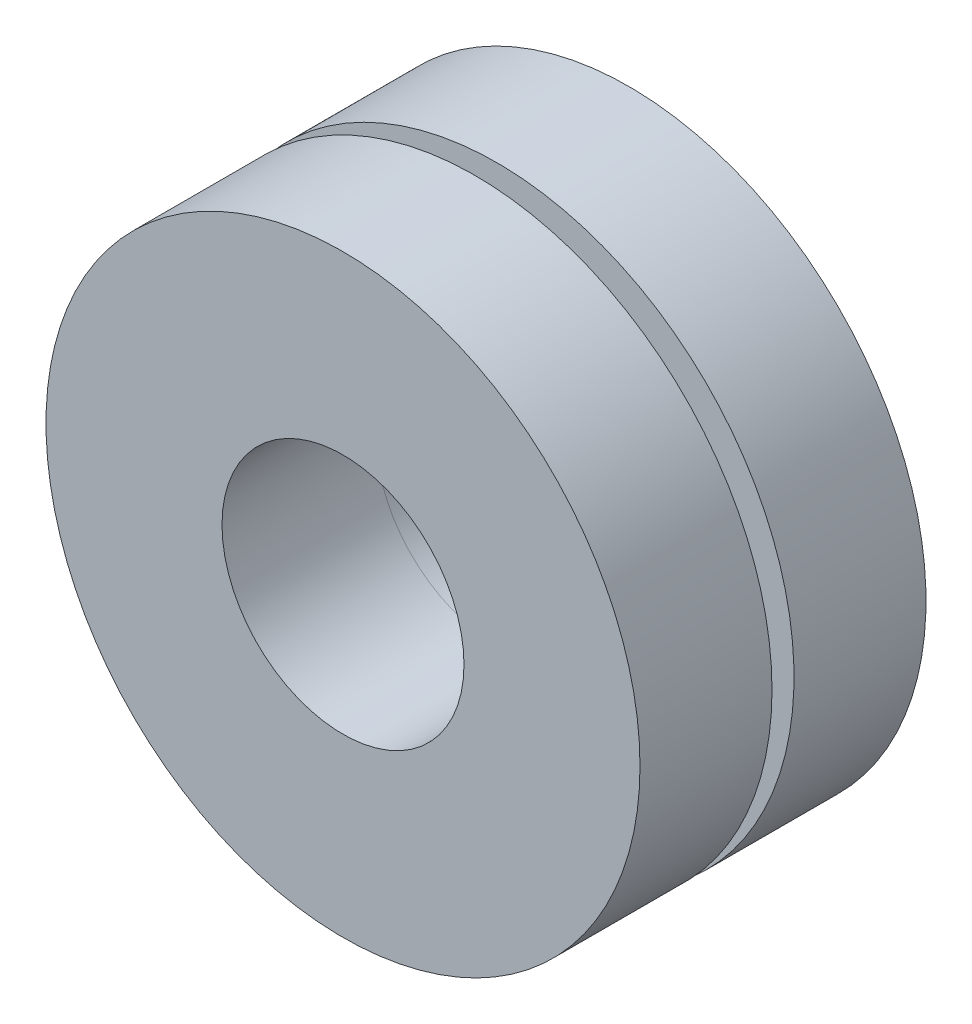
ISO-10303-21;
HEADER;
FILE_DESCRIPTION(('STEP AP214'),'2;1');
FILE_NAME('part.step','',(''),(''),'','','');
FILE_SCHEMA(('AUTOMOTIVE_DESIGN { 1 0 10303 214 1 1 1 1 }'));
ENDSEC;
DATA;
#1=APPLICATION_CONTEXT('core data for automotive mechanical design processes');
#2=APPLICATION_PROTOCOL_DEFINITION('international standard','automotive_design',2000,#1);
#3=PRODUCT_CONTEXT('',#1,'mechanical');
#4=PRODUCT('Part','Part','',(#3));
#5=PRODUCT_RELATED_PRODUCT_CATEGORY('part','',(#4));
#6=PRODUCT_DEFINITION_FORMATION('','',#4);
#7=PRODUCT_DEFINITION_CONTEXT('part definition',#1,'design');
#8=PRODUCT_DEFINITION('design','',#6,#7);
#9=PRODUCT_DEFINITION_SHAPE('','',#8);
#10=(LENGTH_UNIT() NAMED_UNIT(*) SI_UNIT(.MILLI.,.METRE.));
#11=(NAMED_UNIT(*) PLANE_ANGLE_UNIT() SI_UNIT($,.RADIAN.));
#12=(NAMED_UNIT(*) SI_UNIT($,.STERADIAN.) SOLID_ANGLE_UNIT());
#13=UNCERTAINTY_MEASURE_WITH_UNIT(LENGTH_MEASURE(1.E-05),#10,'distance_accuracy_value','');
#14=(GEOMETRIC_REPRESENTATION_CONTEXT(3) GLOBAL_UNCERTAINTY_ASSIGNED_CONTEXT((#13)) GLOBAL_UNIT_ASSIGNED_CONTEXT((#10,
#11,#12)) REPRESENTATION_CONTEXT('',''));
#15=CARTESIAN_POINT('',(0.,0.,0.));
#16=DIRECTION('',(0.,0.,1.));
#17=DIRECTION('',(1.,0.,0.));
#18=AXIS2_PLACEMENT_3D('',#15,#16,#17);
#19=CARTESIAN_POINT('',(0.,0.,-3.048));
#20=DIRECTION('',(0.,0.,-1.));
#21=DIRECTION('',(-1.,0.,0.));
#22=AXIS2_PLACEMENT_3D('',#19,#20,#21);
#23=PLANE('',#22);
#24=CARTESIAN_POINT('',(0.,0.,-3.048));
#25=DIRECTION('',(0.,0.,-1.));
#26=DIRECTION('',(-1.,0.,0.));
#27=AXIS2_PLACEMENT_3D('',#24,#25,#26);
#28=CIRCLE('',#27,6.858);
#29=CARTESIAN_POINT('',(-6.858,0.,-3.048));
#30=VERTEX_POINT('',#29);
#31=EDGE_CURVE('E11',#30,#30,#28,.T.);
#32=ORIENTED_EDGE('',*,*,#31,.T.);
#33=EDGE_LOOP('',(#32));
#34=FACE_BOUND('',#33,.T.);
#35=CARTESIAN_POINT('',(0.,0.,-3.048));
#36=DIRECTION('',(0.,0.,-1.));
#37=DIRECTION('',(-1.,0.,0.));
#38=AXIS2_PLACEMENT_3D('',#35,#36,#37);
#39=CIRCLE('',#38,2.794);
#40=CARTESIAN_POINT('',(-2.794,0.,-3.048));
#41=VERTEX_POINT('',#40);
#42=EDGE_CURVE('E50',#41,#41,#39,.T.);
#43=ORIENTED_EDGE('',*,*,#42,.F.);
#44=EDGE_LOOP('',(#43));
#45=FACE_BOUND('',#44,.T.);
#46=ADVANCED_FACE('F39',(#34,#45),#23,.T.);
#47=CARTESIAN_POINT('',(0.,0.,0.));
#48=DIRECTION('',(0.,0.,-1.));
#49=DIRECTION('',(-1.,0.,0.));
#50=AXIS2_PLACEMENT_3D('',#47,#48,#49);
#51=PLANE('',#50);
#52=CARTESIAN_POINT('',(0.,0.,0.));
#53=DIRECTION('',(0.,0.,-1.));
#54=DIRECTION('',(-1.,0.,0.));
#55=AXIS2_PLACEMENT_3D('',#52,#53,#54);
#56=CIRCLE('',#55,6.858);
#57=CARTESIAN_POINT('',(-6.858,0.,0.));
#58=VERTEX_POINT('',#57);
#59=EDGE_CURVE('E43',#58,#58,#56,.T.);
#60=ORIENTED_EDGE('',*,*,#59,.F.);
#61=EDGE_LOOP('',(#60));
#62=FACE_BOUND('',#61,.T.);
#63=CARTESIAN_POINT('',(0.,0.,0.));
#64=DIRECTION('',(0.,0.,-1.));
#65=DIRECTION('',(-1.,0.,0.));
#66=AXIS2_PLACEMENT_3D('',#63,#64,#65);
#67=CIRCLE('',#66,2.794);
#68=CARTESIAN_POINT('',(-2.794,0.,0.));
#69=VERTEX_POINT('',#68);
#70=EDGE_CURVE('E52',#69,#69,#67,.T.);
#71=ORIENTED_EDGE('',*,*,#70,.T.);
#72=EDGE_LOOP('',(#71));
#73=FACE_BOUND('',#72,.T.);
#74=ADVANCED_FACE('F62',(#62,#73),#51,.F.);
#75=CARTESIAN_POINT('',(0.,0.,-3.048));
#76=DIRECTION('',(0.,0.,1.));
#77=DIRECTION('',(1.,0.,0.));
#78=AXIS2_PLACEMENT_3D('',#75,#76,#77);
#79=CYLINDRICAL_SURFACE('',#78,6.858);
#80=ORIENTED_EDGE('',*,*,#31,.F.);
#81=EDGE_LOOP('',(#80));
#82=FACE_BOUND('',#81,.T.);
#83=ORIENTED_EDGE('',*,*,#59,.T.);
#84=EDGE_LOOP('',(#83));
#85=FACE_BOUND('',#84,.T.);
#86=ADVANCED_FACE('F41',(#82,#85),#79,.T.);
#87=CARTESIAN_POINT('',(0.,0.,-3.048));
#88=DIRECTION('',(0.,0.,1.));
#89=DIRECTION('',(1.,0.,0.));
#90=AXIS2_PLACEMENT_3D('',#87,#88,#89);
#91=CYLINDRICAL_SURFACE('',#90,2.794);
#92=ORIENTED_EDGE('',*,*,#42,.T.);
#93=EDGE_LOOP('',(#92));
#94=FACE_BOUND('',#93,.T.);
#95=ORIENTED_EDGE('',*,*,#70,.F.);
#96=EDGE_LOOP('',(#95));
#97=FACE_BOUND('',#96,.T.);
#98=ADVANCED_FACE('F58',(#94,#97),#91,.F.);
#99=CLOSED_SHELL('',(#46,#74,#86,#98));
#100=MANIFOLD_SOLID_BREP('B2',#99);
#101=CARTESIAN_POINT('',(0.,0.,0.));
#102=DIRECTION('',(0.,0.,1.));
#103=DIRECTION('',(1.,0.,0.));
#104=AXIS2_PLACEMENT_3D('',#101,#102,#103);
#105=PLANE('',#104);
#106=CARTESIAN_POINT('',(0.,0.,0.));
#107=DIRECTION('',(0.,0.,1.));
#108=DIRECTION('',(1.,0.,0.));
#109=AXIS2_PLACEMENT_3D('',#106,#107,#108);
#110=CIRCLE('',#109,4.572);
#111=CARTESIAN_POINT('',(4.572,0.,0.));
#112=VERTEX_POINT('',#111);
#113=EDGE_CURVE('E105',#112,#112,#110,.T.);
#114=ORIENTED_EDGE('',*,*,#113,.F.);
#115=EDGE_LOOP('',(#114));
#116=FACE_BOUND('',#115,.T.);
#117=CARTESIAN_POINT('',(0.,0.,0.));
#118=DIRECTION('',(0.,0.,1.));
#119=DIRECTION('',(1.,0.,0.));
#120=AXIS2_PLACEMENT_3D('',#117,#118,#119);
#121=CIRCLE('',#120,2.794);
#122=CARTESIAN_POINT('',(2.794,0.,0.));
#123=VERTEX_POINT('',#122);
#124=EDGE_CURVE('E112',#123,#123,#121,.T.);
#125=ORIENTED_EDGE('',*,*,#124,.T.);
#126=EDGE_LOOP('',(#125));
#127=FACE_BOUND('',#126,.T.);
#128=ADVANCED_FACE('F101',(#116,#127),#105,.F.);
#129=CARTESIAN_POINT('',(0.,0.,0.508));
#130=DIRECTION('',(0.,0.,-1.));
#131=DIRECTION('',(-1.,0.,0.));
#132=AXIS2_PLACEMENT_3D('',#129,#130,#131);
#133=CYLINDRICAL_SURFACE('',#132,4.572);
#134=CARTESIAN_POINT('',(0.,0.,0.508));
#135=DIRECTION('',(0.,0.,1.));
#136=DIRECTION('',(1.,0.,0.));
#137=AXIS2_PLACEMENT_3D('',#134,#135,#136);
#138=CIRCLE('',#137,4.572);
#139=CARTESIAN_POINT('',(4.572,0.,0.508));
#140=VERTEX_POINT('',#139);
#141=EDGE_CURVE('E38',#140,#140,#138,.T.);
#142=ORIENTED_EDGE('',*,*,#141,.F.);
#143=EDGE_LOOP('',(#142));
#144=FACE_BOUND('',#143,.T.);
#145=ORIENTED_EDGE('',*,*,#113,.T.);
#146=EDGE_LOOP('',(#145));
#147=FACE_BOUND('',#146,.T.);
#148=ADVANCED_FACE('F103',(#144,#147),#133,.T.);
#149=CARTESIAN_POINT('',(0.,0.,0.508));
#150=DIRECTION('',(0.,0.,-1.));
#151=DIRECTION('',(-1.,0.,0.));
#152=AXIS2_PLACEMENT_3D('',#149,#150,#151);
#153=CYLINDRICAL_SURFACE('',#152,2.794);
#154=ORIENTED_EDGE('',*,*,#124,.F.);
#155=EDGE_LOOP('',(#154));
#156=FACE_BOUND('',#155,.T.);
#157=CARTESIAN_POINT('',(0.,0.,3.556));
#158=DIRECTION('',(0.,0.,1.));
#159=DIRECTION('',(1.,0.,0.));
#160=AXIS2_PLACEMENT_3D('',#157,#158,#159);
#161=CIRCLE('',#160,2.794);
#162=CARTESIAN_POINT('',(2.794,0.,3.556));
#163=VERTEX_POINT('',#162);
#164=EDGE_CURVE('E120',#163,#163,#161,.T.);
#165=ORIENTED_EDGE('',*,*,#164,.T.);
#166=EDGE_LOOP('',(#165));
#167=FACE_BOUND('',#166,.T.);
#168=ADVANCED_FACE('F126',(#156,#167),#153,.F.);
#169=CARTESIAN_POINT('',(0.,0.,0.508));
#170=DIRECTION('',(0.,0.,1.));
#171=DIRECTION('',(1.,0.,0.));
#172=AXIS2_PLACEMENT_3D('',#169,#170,#171);
#173=PLANE('',#172);
#174=CARTESIAN_POINT('',(0.,0.,0.508));
#175=DIRECTION('',(0.,0.,1.));
#176=DIRECTION('',(1.,0.,0.));
#177=AXIS2_PLACEMENT_3D('',#174,#175,#176);
#178=CIRCLE('',#177,6.858);
#179=CARTESIAN_POINT('',(6.858,0.,0.508));
#180=VERTEX_POINT('',#179);
#181=EDGE_CURVE('E117',#180,#180,#178,.T.);
#182=ORIENTED_EDGE('',*,*,#181,.F.);
#183=EDGE_LOOP('',(#182));
#184=FACE_BOUND('',#183,.T.);
#185=ORIENTED_EDGE('',*,*,#141,.T.);
#186=EDGE_LOOP('',(#185));
#187=FACE_BOUND('',#186,.T.);
#188=ADVANCED_FACE('F131',(#184,#187),#173,.F.);
#189=CARTESIAN_POINT('',(0.,0.,3.556));
#190=DIRECTION('',(0.,0.,1.));
#191=DIRECTION('',(1.,0.,0.));
#192=AXIS2_PLACEMENT_3D('',#189,#190,#191);
#193=PLANE('',#192);
#194=CARTESIAN_POINT('',(0.,0.,3.556));
#195=DIRECTION('',(0.,0.,1.));
#196=DIRECTION('',(1.,0.,0.));
#197=AXIS2_PLACEMENT_3D('',#194,#195,#196);
#198=CIRCLE('',#197,6.858);
#199=CARTESIAN_POINT('',(6.858,0.,3.556));
#200=VERTEX_POINT('',#199);
#201=EDGE_CURVE('E116',#200,#200,#198,.T.);
#202=ORIENTED_EDGE('',*,*,#201,.T.);
#203=EDGE_LOOP('',(#202));
#204=FACE_BOUND('',#203,.T.);
#205=ORIENTED_EDGE('',*,*,#164,.F.);
#206=EDGE_LOOP('',(#205));
#207=FACE_BOUND('',#206,.T.);
#208=ADVANCED_FACE('F128',(#204,#207),#193,.T.);
#209=CARTESIAN_POINT('',(0.,0.,3.556));
#210=DIRECTION('',(0.,0.,-1.));
#211=DIRECTION('',(-1.,0.,0.));
#212=AXIS2_PLACEMENT_3D('',#209,#210,#211);
#213=CYLINDRICAL_SURFACE('',#212,6.858);
#214=ORIENTED_EDGE('',*,*,#201,.F.);
#215=EDGE_LOOP('',(#214));
#216=FACE_BOUND('',#215,.T.);
#217=ORIENTED_EDGE('',*,*,#181,.T.);
#218=EDGE_LOOP('',(#217));
#219=FACE_BOUND('',#218,.T.);
#220=ADVANCED_FACE('F130',(#216,#219),#213,.T.);
#221=CLOSED_SHELL('',(#128,#148,#168,#188,#208,#220));
#222=MANIFOLD_SOLID_BREP('B6',#221);
#223=ADVANCED_BREP_SHAPE_REPRESENTATION('',(#18,#100,#222),#14);
#224=SHAPE_DEFINITION_REPRESENTATION(#9,#223);
ENDSEC;
END-ISO-10303-21;
